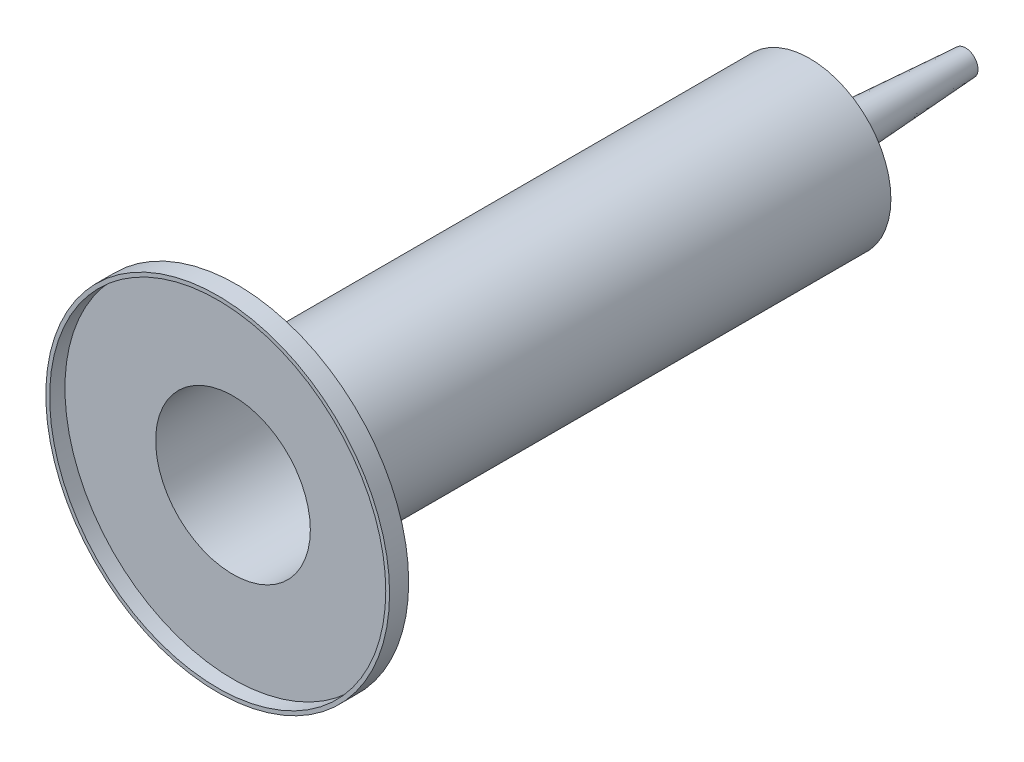
ISO-10303-21;
HEADER;
FILE_DESCRIPTION(('STEP AP214'),'2;1');
FILE_NAME('part.step','',(''),(''),'','','');
FILE_SCHEMA(('AUTOMOTIVE_DESIGN { 1 0 10303 214 1 1 1 1 }'));
ENDSEC;
DATA;
#1=APPLICATION_CONTEXT('core data for automotive mechanical design processes');
#2=APPLICATION_PROTOCOL_DEFINITION('international standard','automotive_design',2000,#1);
#3=PRODUCT_CONTEXT('',#1,'mechanical');
#4=PRODUCT('Part','Part','',(#3));
#5=PRODUCT_RELATED_PRODUCT_CATEGORY('part','',(#4));
#6=PRODUCT_DEFINITION_FORMATION('','',#4);
#7=PRODUCT_DEFINITION_CONTEXT('part definition',#1,'design');
#8=PRODUCT_DEFINITION('design','',#6,#7);
#9=PRODUCT_DEFINITION_SHAPE('','',#8);
#10=(LENGTH_UNIT() NAMED_UNIT(*) SI_UNIT(.MILLI.,.METRE.));
#11=(NAMED_UNIT(*) PLANE_ANGLE_UNIT() SI_UNIT($,.RADIAN.));
#12=(NAMED_UNIT(*) SI_UNIT($,.STERADIAN.) SOLID_ANGLE_UNIT());
#13=UNCERTAINTY_MEASURE_WITH_UNIT(LENGTH_MEASURE(1.E-05),#10,'distance_accuracy_value','');
#14=(GEOMETRIC_REPRESENTATION_CONTEXT(3) GLOBAL_UNCERTAINTY_ASSIGNED_CONTEXT((#13)) GLOBAL_UNIT_ASSIGNED_CONTEXT((#10,
#11,#12)) REPRESENTATION_CONTEXT('',''));
#15=CARTESIAN_POINT('',(0.,0.,0.));
#16=DIRECTION('',(0.,0.,1.));
#17=DIRECTION('',(1.,0.,0.));
#18=AXIS2_PLACEMENT_3D('',#15,#16,#17);
#19=CARTESIAN_POINT('',(0.,0.,150.));
#20=DIRECTION('',(0.,0.,-1.));
#21=DIRECTION('',(-1.,0.,0.));
#22=AXIS2_PLACEMENT_3D('',#19,#20,#21);
#23=CYLINDRICAL_SURFACE('',#22,21.25);
#24=CARTESIAN_POINT('',(0.,0.,150.));
#25=DIRECTION('',(0.,0.,1.));
#26=DIRECTION('',(1.,0.,0.));
#27=AXIS2_PLACEMENT_3D('',#24,#25,#26);
#28=CIRCLE('',#27,21.25);
#29=CARTESIAN_POINT('',(21.25,0.,150.));
#30=VERTEX_POINT('',#29);
#31=EDGE_CURVE('E10',#30,#30,#28,.T.);
#32=ORIENTED_EDGE('',*,*,#31,.F.);
#33=EDGE_LOOP('',(#32));
#34=FACE_BOUND('',#33,.T.);
#35=CARTESIAN_POINT('',(0.,0.,0.));
#36=DIRECTION('',(0.,0.,1.));
#37=DIRECTION('',(1.,0.,0.));
#38=AXIS2_PLACEMENT_3D('',#35,#36,#37);
#39=CIRCLE('',#38,21.25);
#40=CARTESIAN_POINT('',(21.25,0.,0.));
#41=VERTEX_POINT('',#40);
#42=EDGE_CURVE('E61',#41,#41,#39,.T.);
#43=ORIENTED_EDGE('',*,*,#42,.T.);
#44=EDGE_LOOP('',(#43));
#45=FACE_BOUND('',#44,.T.);
#46=ADVANCED_FACE('F39',(#34,#45),#23,.T.);
#47=CARTESIAN_POINT('',(0.,0.,155.));
#48=DIRECTION('',(0.,0.,-1.));
#49=DIRECTION('',(-1.,0.,0.));
#50=AXIS2_PLACEMENT_3D('',#47,#48,#49);
#51=CYLINDRICAL_SURFACE('',#50,45.);
#52=CARTESIAN_POINT('',(0.,0.,155.));
#53=DIRECTION('',(0.,0.,1.));
#54=DIRECTION('',(1.,0.,0.));
#55=AXIS2_PLACEMENT_3D('',#52,#53,#54);
#56=CIRCLE('',#55,45.);
#57=CARTESIAN_POINT('',(45.,0.,155.));
#58=VERTEX_POINT('',#57);
#59=EDGE_CURVE('E45',#58,#58,#56,.T.);
#60=ORIENTED_EDGE('',*,*,#59,.F.);
#61=EDGE_LOOP('',(#60));
#62=FACE_BOUND('',#61,.T.);
#63=CARTESIAN_POINT('',(0.,0.,150.));
#64=DIRECTION('',(0.,0.,1.));
#65=DIRECTION('',(1.,0.,0.));
#66=AXIS2_PLACEMENT_3D('',#63,#64,#65);
#67=CIRCLE('',#66,45.);
#68=CARTESIAN_POINT('',(45.,0.,150.));
#69=VERTEX_POINT('',#68);
#70=EDGE_CURVE('E49',#69,#69,#67,.T.);
#71=ORIENTED_EDGE('',*,*,#70,.T.);
#72=EDGE_LOOP('',(#71));
#73=FACE_BOUND('',#72,.T.);
#74=ADVANCED_FACE('F104',(#62,#73),#51,.T.);
#75=CARTESIAN_POINT('',(0.,0.,155.));
#76=DIRECTION('',(0.,0.,1.));
#77=DIRECTION('',(1.,0.,0.));
#78=AXIS2_PLACEMENT_3D('',#75,#76,#77);
#79=PLANE('',#78);
#80=CARTESIAN_POINT('',(0.,0.,155.));
#81=DIRECTION('',(0.,0.,1.));
#82=DIRECTION('',(1.,0.,0.));
#83=AXIS2_PLACEMENT_3D('',#80,#81,#82);
#84=CIRCLE('',#83,44.);
#85=CARTESIAN_POINT('',(44.,0.,155.));
#86=VERTEX_POINT('',#85);
#87=EDGE_CURVE('E65',#86,#86,#84,.T.);
#88=ORIENTED_EDGE('',*,*,#87,.F.);
#89=EDGE_LOOP('',(#88));
#90=FACE_BOUND('',#89,.T.);
#91=ORIENTED_EDGE('',*,*,#59,.T.);
#92=EDGE_LOOP('',(#91));
#93=FACE_BOUND('',#92,.T.);
#94=ADVANCED_FACE('F109',(#90,#93),#79,.T.);
#95=CARTESIAN_POINT('',(0.,0.,150.));
#96=DIRECTION('',(0.,0.,1.));
#97=DIRECTION('',(1.,0.,0.));
#98=AXIS2_PLACEMENT_3D('',#95,#96,#97);
#99=PLANE('',#98);
#100=ORIENTED_EDGE('',*,*,#31,.T.);
#101=EDGE_LOOP('',(#100));
#102=FACE_BOUND('',#101,.T.);
#103=ORIENTED_EDGE('',*,*,#70,.F.);
#104=EDGE_LOOP('',(#103));
#105=FACE_BOUND('',#104,.T.);
#106=ADVANCED_FACE('F127',(#102,#105),#99,.F.);
#107=CARTESIAN_POINT('',(0.,3.25,-40.8));
#108=DIRECTION('',(0.,0.,1.));
#109=DIRECTION('',(1.,0.,0.));
#110=AXIS2_PLACEMENT_3D('',#107,#108,#109);
#111=PLANE('',#110);
#112=CARTESIAN_POINT('',(0.,0.,-40.8));
#113=DIRECTION('',(0.,0.,1.));
#114=DIRECTION('',(1.,0.,0.));
#115=AXIS2_PLACEMENT_3D('',#112,#113,#114);
#116=CIRCLE('',#115,3.25);
#117=CARTESIAN_POINT('',(3.25,0.,-40.8));
#118=VERTEX_POINT('',#117);
#119=EDGE_CURVE('E54',#118,#118,#116,.T.);
#120=ORIENTED_EDGE('',*,*,#119,.F.);
#121=EDGE_LOOP('',(#120));
#122=FACE_BOUND('',#121,.T.);
#123=ADVANCED_FACE('F122',(#122),#111,.F.);
#124=CARTESIAN_POINT('',(0.,0.,-40.8));
#125=DIRECTION('',(0.,0.,1.));
#126=DIRECTION('',(1.,0.,0.));
#127=AXIS2_PLACEMENT_3D('',#124,#125,#126);
#128=CONICAL_SURFACE('',#127,3.25,0.0616863435457363);
#129=CARTESIAN_POINT('',(0.,0.,-6.8));
#130=DIRECTION('',(0.,0.,1.));
#131=DIRECTION('',(1.,0.,0.));
#132=AXIS2_PLACEMENT_3D('',#129,#130,#131);
#133=CIRCLE('',#132,5.35);
#134=CARTESIAN_POINT('',(5.35,0.,-6.8));
#135=VERTEX_POINT('',#134);
#136=EDGE_CURVE('E58',#135,#135,#133,.T.);
#137=ORIENTED_EDGE('',*,*,#136,.F.);
#138=EDGE_LOOP('',(#137));
#139=FACE_BOUND('',#138,.T.);
#140=ORIENTED_EDGE('',*,*,#119,.T.);
#141=EDGE_LOOP('',(#140));
#142=FACE_BOUND('',#141,.T.);
#143=ADVANCED_FACE('F116',(#139,#142),#128,.T.);
#144=CARTESIAN_POINT('',(0.,0.,-6.8));
#145=DIRECTION('',(0.,0.,1.));
#146=DIRECTION('',(1.,0.,0.));
#147=AXIS2_PLACEMENT_3D('',#144,#145,#146);
#148=CONICAL_SURFACE('',#147,5.35,1.16666384180656);
#149=CARTESIAN_POINT('',(21.25,0.,0.));
#150=CARTESIAN_POINT('',(21.084375,0.,-0.0708333333333336));
#151=CARTESIAN_POINT('',(20.91875,0.,-0.141666666666667));
#152=CARTESIAN_POINT('',(20.5875,0.,-0.283333333333334));
#153=CARTESIAN_POINT('',(20.421875,0.,-0.354166666666668));
#154=CARTESIAN_POINT('',(20.090625,0.,-0.495833333333334));
#155=CARTESIAN_POINT('',(19.925,0.,-0.566666666666668));
#156=CARTESIAN_POINT('',(19.59375,0.,-0.708333333333334));
#157=CARTESIAN_POINT('',(19.428125,0.,-0.779166666666668));
#158=CARTESIAN_POINT('',(19.096875,0.,-0.920833333333334));
#159=CARTESIAN_POINT('',(18.93125,0.,-0.991666666666668));
#160=CARTESIAN_POINT('',(18.6,0.,-1.13333333333333));
#161=CARTESIAN_POINT('',(18.434375,0.,-1.20416666666667));
#162=CARTESIAN_POINT('',(18.103125,0.,-1.34583333333333));
#163=CARTESIAN_POINT('',(17.9375,0.,-1.41666666666667));
#164=CARTESIAN_POINT('',(17.60625,0.,-1.55833333333333));
#165=CARTESIAN_POINT('',(17.440625,0.,-1.62916666666667));
#166=CARTESIAN_POINT('',(17.109375,0.,-1.77083333333333));
#167=CARTESIAN_POINT('',(16.94375,0.,-1.84166666666667));
#168=CARTESIAN_POINT('',(16.6125,0.,-1.98333333333334));
#169=CARTESIAN_POINT('',(16.446875,0.,-2.05416666666667));
#170=CARTESIAN_POINT('',(16.115625,0.,-2.19583333333333));
#171=CARTESIAN_POINT('',(15.95,0.,-2.26666666666667));
#172=CARTESIAN_POINT('',(15.61875,0.,-2.40833333333334));
#173=CARTESIAN_POINT('',(15.453125,0.,-2.47916666666667));
#174=CARTESIAN_POINT('',(15.121875,0.,-2.62083333333334));
#175=CARTESIAN_POINT('',(14.95625,0.,-2.69166666666667));
#176=CARTESIAN_POINT('',(14.625,0.,-2.83333333333334));
#177=CARTESIAN_POINT('',(14.459375,0.,-2.90416666666667));
#178=CARTESIAN_POINT('',(14.128125,0.,-3.04583333333334));
#179=CARTESIAN_POINT('',(13.9625,0.,-3.11666666666667));
#180=CARTESIAN_POINT('',(13.63125,0.,-3.25833333333334));
#181=CARTESIAN_POINT('',(13.465625,0.,-3.32916666666667));
#182=CARTESIAN_POINT('',(13.134375,0.,-3.47083333333334));
#183=CARTESIAN_POINT('',(12.96875,0.,-3.54166666666667));
#184=CARTESIAN_POINT('',(12.6375,0.,-3.68333333333334));
#185=CARTESIAN_POINT('',(12.471875,0.,-3.75416666666667));
#186=CARTESIAN_POINT('',(12.140625,0.,-3.89583333333334));
#187=CARTESIAN_POINT('',(11.975,0.,-3.96666666666667));
#188=CARTESIAN_POINT('',(11.64375,0.,-4.10833333333334));
#189=CARTESIAN_POINT('',(11.478125,0.,-4.17916666666667));
#190=CARTESIAN_POINT('',(11.146875,0.,-4.32083333333334));
#191=CARTESIAN_POINT('',(10.98125,0.,-4.39166666666667));
#192=CARTESIAN_POINT('',(10.65,0.,-4.53333333333333));
#193=CARTESIAN_POINT('',(10.484375,0.,-4.60416666666667));
#194=CARTESIAN_POINT('',(10.153125,0.,-4.74583333333334));
#195=CARTESIAN_POINT('',(9.9875,0.,-4.81666666666667));
#196=CARTESIAN_POINT('',(9.65625,0.,-4.95833333333334));
#197=CARTESIAN_POINT('',(9.490625,0.,-5.02916666666667));
#198=CARTESIAN_POINT('',(9.159375,0.,-5.17083333333334));
#199=CARTESIAN_POINT('',(8.99375,0.,-5.24166666666667));
#200=CARTESIAN_POINT('',(8.6625,0.,-5.38333333333334));
#201=CARTESIAN_POINT('',(8.496875,0.,-5.45416666666667));
#202=CARTESIAN_POINT('',(8.165625,0.,-5.59583333333334));
#203=CARTESIAN_POINT('',(8.,0.,-5.66666666666667));
#204=CARTESIAN_POINT('',(7.66875,0.,-5.80833333333334));
#205=CARTESIAN_POINT('',(7.503125,0.,-5.87916666666667));
#206=CARTESIAN_POINT('',(7.171875,0.,-6.02083333333334));
#207=CARTESIAN_POINT('',(7.00625,0.,-6.09166666666667));
#208=CARTESIAN_POINT('',(6.675,0.,-6.23333333333334));
#209=CARTESIAN_POINT('',(6.509375,0.,-6.30416666666667));
#210=CARTESIAN_POINT('',(6.178125,0.,-6.44583333333334));
#211=CARTESIAN_POINT('',(6.0125,0.,-6.51666666666667));
#212=CARTESIAN_POINT('',(5.68125,0.,-6.65833333333334));
#213=CARTESIAN_POINT('',(5.515625,0.,-6.72916666666667));
#214=CARTESIAN_POINT('',(5.35,0.,-6.8));
#215=B_SPLINE_CURVE_WITH_KNOTS('',3,(#149,#150,#151,#152,#153,#154,#155,#156,#157,#158,#159,
#160,#161,#162,#163,#164,#165,#166,#167,#168,#169,#170,#171,#172,#173,#174,#175,#176,#177,#178,
#179,#180,#181,#182,#183,#184,#185,#186,#187,#188,#189,#190,#191,#192,#193,#194,#195,#196,#197,
#198,#199,#200,#201,#202,#203,#204,#205,#206,#207,#208,#209,#210,#211,#212,#213,#214),
.UNSPECIFIED.,.F.,.F.,(4,2,2,2,2,2,2,2,2,2,2,2,2,2,2,2,2,2,2,2,2,2,2,2,2,2,2,2,2,2,2,2,4),(0.,
0.540408193521343,1.08081638704268,1.62122458056402,2.16163277408537,2.70204096760671,
3.24244916112805,3.7828573546494,4.32326554817073,4.86367374169208,5.40408193521342,
5.94449012873476,6.4848983222561,7.02530651577745,7.56571470929879,8.10612290282013,
8.64653109634147,9.18693928986281,9.72734748338415,10.2677556769055,10.8081638704268,
11.3485720639482,11.8889802574695,12.4293884509909,12.9697966445122,13.5102048380335,
14.0506130315549,14.5910212250762,15.1314294185976,15.6718376121189,16.2122458056403,
16.7526539991616,17.2930621926829),.UNSPECIFIED.);
#216=EDGE_CURVE('BSEAM101',#41,#135,#215,.T.);
#217=ORIENTED_EDGE('',*,*,#42,.F.);
#218=ORIENTED_EDGE('',*,*,#136,.T.);
#219=ORIENTED_EDGE('',*,*,#216,.T.);
#220=ORIENTED_EDGE('',*,*,#216,.F.);
#221=EDGE_LOOP('',(#217,#219,#218,#220));
#222=FACE_BOUND('',#221,.T.);
#223=ADVANCED_FACE('F101',(#222),#148,.T.);
#224=CARTESIAN_POINT('',(0.,0.,150.));
#225=DIRECTION('',(0.,0.,-1.));
#226=DIRECTION('',(-1.,0.,0.));
#227=AXIS2_PLACEMENT_3D('',#224,#225,#226);
#228=CYLINDRICAL_SURFACE('',#227,20.25);
#229=CARTESIAN_POINT('',(0.,0.,151.));
#230=DIRECTION('',(0.,0.,1.));
#231=DIRECTION('',(1.,0.,0.));
#232=AXIS2_PLACEMENT_3D('',#229,#230,#231);
#233=CIRCLE('',#232,20.25);
#234=CARTESIAN_POINT('',(20.25,0.,151.));
#235=VERTEX_POINT('',#234);
#236=EDGE_CURVE('E64',#235,#235,#233,.T.);
#237=ORIENTED_EDGE('',*,*,#236,.T.);
#238=EDGE_LOOP('',(#237));
#239=FACE_BOUND('',#238,.T.);
#240=CARTESIAN_POINT('',(0.,0.,0.659941018407729));
#241=DIRECTION('',(0.,0.,1.));
#242=DIRECTION('',(1.,0.,0.));
#243=AXIS2_PLACEMENT_3D('',#240,#241,#242);
#244=CIRCLE('',#243,20.25);
#245=CARTESIAN_POINT('',(20.25,0.,0.659941018407729));
#246=VERTEX_POINT('',#245);
#247=EDGE_CURVE('E75',#246,#246,#244,.T.);
#248=ORIENTED_EDGE('',*,*,#247,.F.);
#249=EDGE_LOOP('',(#248));
#250=FACE_BOUND('',#249,.T.);
#251=ADVANCED_FACE('F83',(#239,#250),#228,.F.);
#252=CARTESIAN_POINT('',(0.,0.,155.));
#253=DIRECTION('',(0.,0.,-1.));
#254=DIRECTION('',(-1.,0.,0.));
#255=AXIS2_PLACEMENT_3D('',#252,#253,#254);
#256=CYLINDRICAL_SURFACE('',#255,44.);
#257=ORIENTED_EDGE('',*,*,#87,.T.);
#258=EDGE_LOOP('',(#257));
#259=FACE_BOUND('',#258,.T.);
#260=CARTESIAN_POINT('',(0.,0.,151.));
#261=DIRECTION('',(0.,0.,1.));
#262=DIRECTION('',(1.,0.,0.));
#263=AXIS2_PLACEMENT_3D('',#260,#261,#262);
#264=CIRCLE('',#263,44.);
#265=CARTESIAN_POINT('',(44.,0.,151.));
#266=VERTEX_POINT('',#265);
#267=EDGE_CURVE('E68',#266,#266,#264,.T.);
#268=ORIENTED_EDGE('',*,*,#267,.F.);
#269=EDGE_LOOP('',(#268));
#270=FACE_BOUND('',#269,.T.);
#271=ADVANCED_FACE('F90',(#259,#270),#256,.F.);
#272=CARTESIAN_POINT('',(0.,0.,151.));
#273=DIRECTION('',(0.,0.,1.));
#274=DIRECTION('',(1.,0.,0.));
#275=AXIS2_PLACEMENT_3D('',#272,#273,#274);
#276=PLANE('',#275);
#277=ORIENTED_EDGE('',*,*,#236,.F.);
#278=EDGE_LOOP('',(#277));
#279=FACE_BOUND('',#278,.T.);
#280=ORIENTED_EDGE('',*,*,#267,.T.);
#281=EDGE_LOOP('',(#280));
#282=FACE_BOUND('',#281,.T.);
#283=ADVANCED_FACE('F86',(#279,#282),#276,.T.);
#284=CARTESIAN_POINT('',(0.,3.25,-39.8));
#285=DIRECTION('',(0.,0.,1.));
#286=DIRECTION('',(1.,0.,0.));
#287=AXIS2_PLACEMENT_3D('',#284,#285,#286);
#288=PLANE('',#287);
#289=CARTESIAN_POINT('',(0.,0.,-39.8));
#290=DIRECTION('',(0.,0.,1.));
#291=DIRECTION('',(1.,0.,0.));
#292=AXIS2_PLACEMENT_3D('',#289,#290,#291);
#293=CIRCLE('',#292,2.30985908213692);
#294=CARTESIAN_POINT('',(2.30985908213692,0.,-39.8));
#295=VERTEX_POINT('',#294);
#296=EDGE_CURVE('E69',#295,#295,#293,.T.);
#297=ORIENTED_EDGE('',*,*,#296,.T.);
#298=EDGE_LOOP('',(#297));
#299=FACE_BOUND('',#298,.T.);
#300=ADVANCED_FACE('F89',(#299),#288,.T.);
#301=CARTESIAN_POINT('',(0.,0.,-40.738352770542));
#302=DIRECTION('',(0.,0.,1.));
#303=DIRECTION('',(1.,0.,0.));
#304=AXIS2_PLACEMENT_3D('',#301,#302,#303);
#305=CONICAL_SURFACE('',#304,2.2519019992505,0.0616863435457363);
#306=CARTESIAN_POINT('',(0.,0.,-6.12299070082597));
#307=DIRECTION('',(0.,0.,1.));
#308=DIRECTION('',(1.,0.,0.));
#309=AXIS2_PLACEMENT_3D('',#306,#307,#308);
#310=CIRCLE('',#309,4.38990965649766);
#311=CARTESIAN_POINT('',(4.38990965649767,0.,-6.12299070082597));
#312=VERTEX_POINT('',#311);
#313=EDGE_CURVE('E72',#312,#312,#310,.T.);
#314=ORIENTED_EDGE('',*,*,#313,.T.);
#315=EDGE_LOOP('',(#314));
#316=FACE_BOUND('',#315,.T.);
#317=ORIENTED_EDGE('',*,*,#296,.F.);
#318=EDGE_LOOP('',(#317));
#319=FACE_BOUND('',#318,.T.);
#320=ADVANCED_FACE('F172',(#316,#319),#305,.F.);
#321=CARTESIAN_POINT('',(0.,0.,-5.88055613153768));
#322=DIRECTION('',(0.,0.,1.));
#323=DIRECTION('',(1.,0.,0.));
#324=AXIS2_PLACEMENT_3D('',#321,#322,#323);
#325=CONICAL_SURFACE('',#324,4.95677872292177,1.16666384180656);
#326=CARTESIAN_POINT('',(20.25,0.,0.659941018407729));
#327=CARTESIAN_POINT('',(20.0847907255885,0.,0.589285479665711));
#328=CARTESIAN_POINT('',(19.919581451177,0.,0.518629940923694));
#329=CARTESIAN_POINT('',(19.5891629023541,0.,0.377318863439658));
#330=CARTESIAN_POINT('',(19.4239536279426,0.,0.30666332469764));
#331=CARTESIAN_POINT('',(19.0935350791196,0.,0.165352247213605));
#332=CARTESIAN_POINT('',(18.9283258047081,0.,0.0946967084715875));
#333=CARTESIAN_POINT('',(18.5979072558852,0.,-0.0466143690124482));
#334=CARTESIAN_POINT('',(18.4326979814737,0.,-0.117269907754466));
#335=CARTESIAN_POINT('',(18.1022794326507,0.,-0.258580985238502));
#336=CARTESIAN_POINT('',(17.9370701582392,0.,-0.329236523980519));
#337=CARTESIAN_POINT('',(17.6066516094163,0.,-0.470547601464555));
#338=CARTESIAN_POINT('',(17.4414423350048,0.,-0.541203140206572));
#339=CARTESIAN_POINT('',(17.1110237861818,0.,-0.682514217690608));
#340=CARTESIAN_POINT('',(16.9458145117703,0.,-0.753169756432626));
#341=CARTESIAN_POINT('',(16.6153959629474,0.,-0.894480833916661));
#342=CARTESIAN_POINT('',(16.4501866885359,0.,-0.965136372658679));
#343=CARTESIAN_POINT('',(16.1197681397129,0.,-1.10644745014271));
#344=CARTESIAN_POINT('',(15.9545588653015,0.,-1.17710298888473));
#345=CARTESIAN_POINT('',(15.6241403164785,0.,-1.31841406636877));
#346=CARTESIAN_POINT('',(15.458931042067,0.,-1.38906960511079));
#347=CARTESIAN_POINT('',(15.128512493244,0.,-1.53038068259482));
#348=CARTESIAN_POINT('',(14.9633032188326,0.,-1.60103622133684));
#349=CARTESIAN_POINT('',(14.6328846700096,0.,-1.74234729882087));
#350=CARTESIAN_POINT('',(14.4676753955981,0.,-1.81300283756289));
#351=CARTESIAN_POINT('',(14.1372568467751,0.,-1.95431391504693));
#352=CARTESIAN_POINT('',(13.9720475723637,0.,-2.02496945378895));
#353=CARTESIAN_POINT('',(13.6416290235407,0.,-2.16628053127298));
#354=CARTESIAN_POINT('',(13.4764197491292,0.,-2.236936070015));
#355=CARTESIAN_POINT('',(13.1460012003062,0.,-2.37824714749903));
#356=CARTESIAN_POINT('',(12.9807919258948,0.,-2.44890268624105));
#357=CARTESIAN_POINT('',(12.6503733770718,0.,-2.59021376372509));
#358=CARTESIAN_POINT('',(12.4851641026603,0.,-2.6608693024671));
#359=CARTESIAN_POINT('',(12.1547455538374,0.,-2.80218037995114));
#360=CARTESIAN_POINT('',(11.9895362794259,0.,-2.87283591869316));
#361=CARTESIAN_POINT('',(11.6591177306029,0.,-3.01414699617719));
#362=CARTESIAN_POINT('',(11.4939084561914,0.,-3.08480253491921));
#363=CARTESIAN_POINT('',(11.1634899073685,0.,-3.22611361240325));
#364=CARTESIAN_POINT('',(10.998280632957,0.,-3.29676915114526));
#365=CARTESIAN_POINT('',(10.667862084134,0.,-3.4380802286293));
#366=CARTESIAN_POINT('',(10.5026528097225,0.,-3.50873576737132));
#367=CARTESIAN_POINT('',(10.1722342608996,0.,-3.65004684485535));
#368=CARTESIAN_POINT('',(10.0070249864881,0.,-3.72070238359737));
#369=CARTESIAN_POINT('',(9.67660643766511,0.,-3.86201346108141));
#370=CARTESIAN_POINT('',(9.51139716325363,0.,-3.93266899982342));
#371=CARTESIAN_POINT('',(9.18097861443066,0.,-4.07398007730746));
#372=CARTESIAN_POINT('',(9.01576934001918,0.,-4.14463561604948));
#373=CARTESIAN_POINT('',(8.68535079119621,0.,-4.28594669353351));
#374=CARTESIAN_POINT('',(8.52014151678473,0.,-4.35660223227553));
#375=CARTESIAN_POINT('',(8.18972296796177,0.,-4.49791330975957));
#376=CARTESIAN_POINT('',(8.02451369355028,0.,-4.56856884850158));
#377=CARTESIAN_POINT('',(7.69409514472732,0.,-4.70987992598562));
#378=CARTESIAN_POINT('',(7.52888587031584,0.,-4.78053546472764));
#379=CARTESIAN_POINT('',(7.19846732149287,0.,-4.92184654221167));
#380=CARTESIAN_POINT('',(7.03325804708139,0.,-4.99250208095369));
#381=CARTESIAN_POINT('',(6.70283949825842,0.,-5.13381315843773));
#382=CARTESIAN_POINT('',(6.53763022384694,0.,-5.20446869717974));
#383=CARTESIAN_POINT('',(6.20721167502398,0.,-5.34577977466378));
#384=CARTESIAN_POINT('',(6.04200240061249,0.,-5.4164353134058));
#385=CARTESIAN_POINT('',(5.71158385178953,0.,-5.55774639088983));
#386=CARTESIAN_POINT('',(5.54637457737805,0.,-5.62840192963185));
#387=CARTESIAN_POINT('',(5.21595602855508,0.,-5.76971300711589));
#388=CARTESIAN_POINT('',(5.0507467541436,0.,-5.8403685458579));
#389=CARTESIAN_POINT('',(4.72032820532063,0.,-5.98167962334194));
#390=CARTESIAN_POINT('',(4.55511893090915,0.,-6.05233516208396));
#391=CARTESIAN_POINT('',(4.38990965649767,0.,-6.12299070082597));
#392=B_SPLINE_CURVE_WITH_KNOTS('',3,(#326,#327,#328,#329,#330,#331,#332,#333,#334,#335,#336,
#337,#338,#339,#340,#341,#342,#343,#344,#345,#346,#347,#348,#349,#350,#351,#352,#353,#354,#355,
#356,#357,#358,#359,#360,#361,#362,#363,#364,#365,#366,#367,#368,#369,#370,#371,#372,#373,#374,
#375,#376,#377,#378,#379,#380,#381,#382,#383,#384,#385,#386,#387,#388,#389,#390,#391),
.UNSPECIFIED.,.F.,.F.,(4,2,2,2,2,2,2,2,2,2,2,2,2,2,2,2,2,2,2,2,2,2,2,2,2,2,2,2,2,2,2,2,4),(0.,
0.539051746642599,1.0781034932852,1.61715523992781,2.15620698657041,2.69525873321301,
3.23431047985561,3.77336222649821,4.31241397314082,4.85146571978342,5.39051746642602,
5.92956921306862,6.46862095971122,7.00767270635383,7.54672445299643,8.08577619963903,
8.62482794628163,9.16387969292424,9.70293143956684,10.2419831862094,10.781034932852,
11.3200866794946,11.8591384261372,12.3981901727799,12.9372419194225,13.4762936660651,
14.0153454127077,14.5543971593503,15.0934489059929,15.6325006526355,16.1715523992781,
16.7106041459207,17.2496558925633),.UNSPECIFIED.);
#393=EDGE_CURVE('BSEAM182',#246,#312,#392,.T.);
#394=ORIENTED_EDGE('',*,*,#247,.T.);
#395=ORIENTED_EDGE('',*,*,#313,.F.);
#396=ORIENTED_EDGE('',*,*,#393,.T.);
#397=ORIENTED_EDGE('',*,*,#393,.F.);
#398=EDGE_LOOP('',(#394,#396,#395,#397));
#399=FACE_BOUND('',#398,.T.);
#400=ADVANCED_FACE('F182',(#399),#325,.F.);
#401=CLOSED_SHELL('',(#46,#74,#94,#106,#123,#143,#223,#251,#271,#283,#300,#320,#400));
#402=MANIFOLD_SOLID_BREP('B2',#401);
#403=ADVANCED_BREP_SHAPE_REPRESENTATION('',(#18,#402),#14);
#404=SHAPE_DEFINITION_REPRESENTATION(#9,#403);
ENDSEC;
END-ISO-10303-21;
